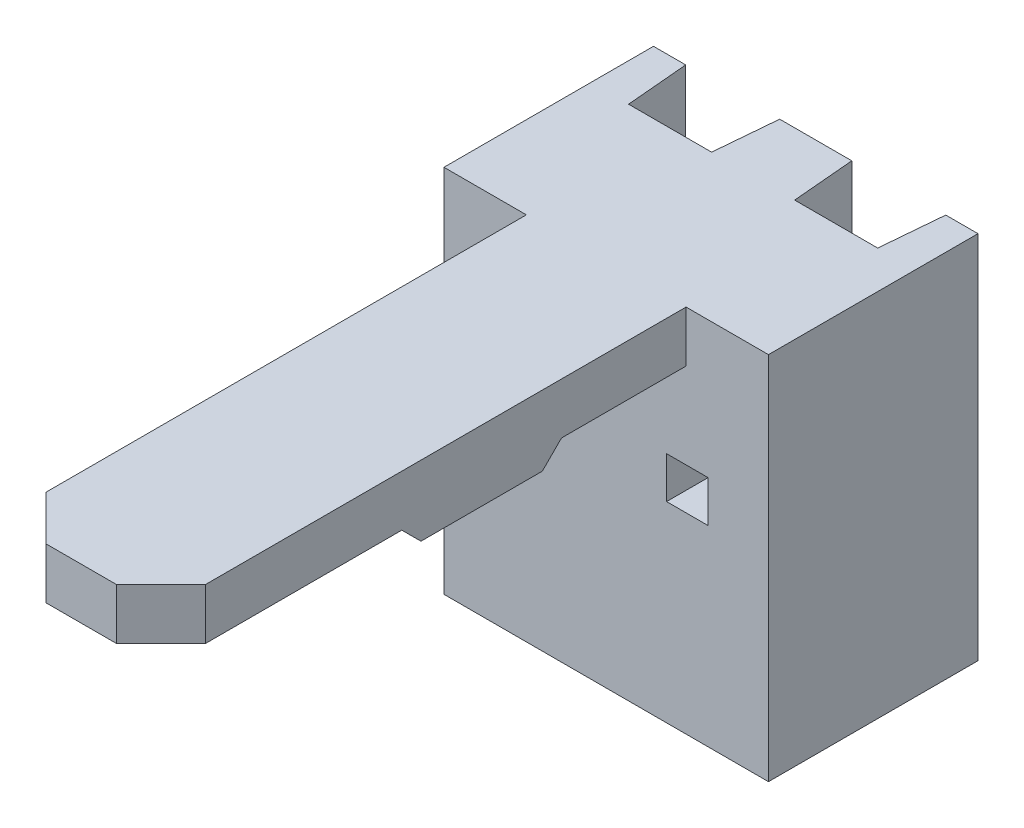
ISO-10303-21;
HEADER;
FILE_DESCRIPTION(('STEP AP214'),'2;1');
FILE_NAME('part.step','',(''),(''),'','','');
FILE_SCHEMA(('AUTOMOTIVE_DESIGN { 1 0 10303 214 1 1 1 1 }'));
ENDSEC;
DATA;
#1=APPLICATION_CONTEXT('core data for automotive mechanical design processes');
#2=APPLICATION_PROTOCOL_DEFINITION('international standard','automotive_design',2000,#1);
#3=PRODUCT_CONTEXT('',#1,'mechanical');
#4=PRODUCT('Part','Part','',(#3));
#5=PRODUCT_RELATED_PRODUCT_CATEGORY('part','',(#4));
#6=PRODUCT_DEFINITION_FORMATION('','',#4);
#7=PRODUCT_DEFINITION_CONTEXT('part definition',#1,'design');
#8=PRODUCT_DEFINITION('design','',#6,#7);
#9=PRODUCT_DEFINITION_SHAPE('','',#8);
#10=(LENGTH_UNIT() NAMED_UNIT(*) SI_UNIT(.MILLI.,.METRE.));
#11=(NAMED_UNIT(*) PLANE_ANGLE_UNIT() SI_UNIT($,.RADIAN.));
#12=(NAMED_UNIT(*) SI_UNIT($,.STERADIAN.) SOLID_ANGLE_UNIT());
#13=UNCERTAINTY_MEASURE_WITH_UNIT(LENGTH_MEASURE(1.E-05),#10,'distance_accuracy_value','');
#14=(GEOMETRIC_REPRESENTATION_CONTEXT(3) GLOBAL_UNCERTAINTY_ASSIGNED_CONTEXT((#13)) GLOBAL_UNIT_ASSIGNED_CONTEXT((#10,
#11,#12)) REPRESENTATION_CONTEXT('',''));
#15=CARTESIAN_POINT('',(0.,0.,0.));
#16=DIRECTION('',(0.,0.,1.));
#17=DIRECTION('',(1.,0.,0.));
#18=AXIS2_PLACEMENT_3D('',#15,#16,#17);
#19=CARTESIAN_POINT('',(0.,0.,-3.28));
#20=DIRECTION('',(0.,0.,1.));
#21=DIRECTION('',(1.,0.,0.));
#22=AXIS2_PLACEMENT_3D('',#19,#20,#21);
#23=PLANE('',#22);
#24=DIRECTION('',(1.,0.,0.));
#25=VECTOR('',#24,1.);
#26=CARTESIAN_POINT('',(0.,-2.895,-3.28));
#27=LINE('',#26,#25);
#28=CARTESIAN_POINT('',(-0.564261109744597,-2.895,-3.28));
#29=VERTEX_POINT('',#28);
#30=CARTESIAN_POINT('',(0.564261109744597,-2.895,-3.28));
#31=VERTEX_POINT('',#30);
#32=EDGE_CURVE('E287',#29,#31,#27,.T.);
#33=ORIENTED_EDGE('',*,*,#32,.F.);
#34=DIRECTION('',(0.,1.,0.));
#35=VECTOR('',#34,1.);
#36=CARTESIAN_POINT('',(-0.564261109744589,3.061095129369,-3.28));
#37=LINE('',#36,#35);
#38=CARTESIAN_POINT('',(-0.564261109744597,2.895,-3.28));
#39=VERTEX_POINT('',#38);
#40=EDGE_CURVE('E289',#29,#39,#37,.T.);
#41=ORIENTED_EDGE('',*,*,#40,.T.);
#42=DIRECTION('',(1.,0.,0.));
#43=VECTOR('',#42,1.);
#44=CARTESIAN_POINT('',(0.,2.895,-3.28));
#45=LINE('',#44,#43);
#46=CARTESIAN_POINT('',(0.564261109744597,2.895,-3.28));
#47=VERTEX_POINT('',#46);
#48=EDGE_CURVE('E19',#47,#39,#45,.F.);
#49=ORIENTED_EDGE('',*,*,#48,.F.);
#50=DIRECTION('',(0.,1.,0.));
#51=VECTOR('',#50,1.);
#52=CARTESIAN_POINT('',(0.564261109744589,3.061095129369,-3.28));
#53=LINE('',#52,#51);
#54=EDGE_CURVE('E320',#47,#31,#53,.F.);
#55=ORIENTED_EDGE('',*,*,#54,.T.);
#56=EDGE_LOOP('',(#33,#41,#49,#55));
#57=FACE_BOUND('',#56,.T.);
#58=ADVANCED_FACE('F16',(#57),#23,.F.);
#59=CARTESIAN_POINT('',(-0.65,3.061095129369,-2.3));
#60=DIRECTION('',(0.996194698091745,0.,0.087155742747664));
#61=DIRECTION('',(0.087155742747664,0.,-0.996194698091745));
#62=AXIS2_PLACEMENT_3D('',#59,#60,#61);
#63=PLANE('',#62);
#64=DIRECTION('',(0.087155742747664,0.,-0.996194698091745));
#65=VECTOR('',#64,1.);
#66=CARTESIAN_POINT('',(-0.65,-2.895,-2.3));
#67=LINE('',#66,#65);
#68=CARTESIAN_POINT('',(-0.65,-2.895,-2.3));
#69=VERTEX_POINT('',#68);
#70=EDGE_CURVE('E270',#69,#29,#67,.T.);
#71=ORIENTED_EDGE('',*,*,#70,.F.);
#72=DIRECTION('',(0.,1.,0.));
#73=VECTOR('',#72,1.);
#74=CARTESIAN_POINT('',(-0.65,-2.895,-2.3));
#75=LINE('',#74,#73);
#76=CARTESIAN_POINT('',(-0.65,2.895,-2.3));
#77=VERTEX_POINT('',#76);
#78=EDGE_CURVE('E296',#69,#77,#75,.T.);
#79=ORIENTED_EDGE('',*,*,#78,.T.);
#80=DIRECTION('',(0.087155742747664,0.,-0.996194698091745));
#81=VECTOR('',#80,1.);
#82=CARTESIAN_POINT('',(-0.65,2.895,-2.3));
#83=LINE('',#82,#81);
#84=EDGE_CURVE('E279',#39,#77,#83,.F.);
#85=ORIENTED_EDGE('',*,*,#84,.F.);
#86=ORIENTED_EDGE('',*,*,#40,.F.);
#87=EDGE_LOOP('',(#71,#79,#85,#86));
#88=FACE_BOUND('',#87,.T.);
#89=ADVANCED_FACE('F294',(#88),#63,.F.);
#90=CARTESIAN_POINT('',(-1.595,0.755,0.));
#91=DIRECTION('',(-1.,0.,0.));
#92=DIRECTION('',(0.,0.,1.));
#93=AXIS2_PLACEMENT_3D('',#90,#91,#92);
#94=PLANE('',#93);
#95=DIRECTION('',(0.,0.,-1.));
#96=VECTOR('',#95,1.);
#97=CARTESIAN_POINT('',(-1.595,0.105,0.));
#98=LINE('',#97,#96);
#99=CARTESIAN_POINT('',(-1.595,0.105,0.));
#100=VERTEX_POINT('',#99);
#101=CARTESIAN_POINT('',(-1.595,0.105,-2.3));
#102=VERTEX_POINT('',#101);
#103=EDGE_CURVE('E323',#100,#102,#98,.T.);
#104=ORIENTED_EDGE('',*,*,#103,.T.);
#105=DIRECTION('',(0.,1.,0.));
#106=VECTOR('',#105,1.);
#107=CARTESIAN_POINT('',(-1.595,-2.895,-2.3));
#108=LINE('',#107,#106);
#109=CARTESIAN_POINT('',(-1.595,0.755,-2.3));
#110=VERTEX_POINT('',#109);
#111=EDGE_CURVE('E337',#102,#110,#108,.T.);
#112=ORIENTED_EDGE('',*,*,#111,.T.);
#113=DIRECTION('',(0.,0.,1.));
#114=VECTOR('',#113,1.);
#115=CARTESIAN_POINT('',(-1.595,0.755,0.));
#116=LINE('',#115,#114);
#117=CARTESIAN_POINT('',(-1.595,0.755,0.));
#118=VERTEX_POINT('',#117);
#119=EDGE_CURVE('E348',#110,#118,#116,.T.);
#120=ORIENTED_EDGE('',*,*,#119,.T.);
#121=DIRECTION('',(0.,1.,0.));
#122=VECTOR('',#121,1.);
#123=CARTESIAN_POINT('',(-1.595,0.755,0.));
#124=LINE('',#123,#122);
#125=EDGE_CURVE('E292',#100,#118,#124,.T.);
#126=ORIENTED_EDGE('',*,*,#125,.F.);
#127=EDGE_LOOP('',(#104,#112,#120,#126));
#128=FACE_BOUND('',#127,.T.);
#129=ADVANCED_FACE('F641',(#128),#94,.F.);
#130=CARTESIAN_POINT('',(0.945,0.755,0.));
#131=DIRECTION('',(-1.,0.,0.));
#132=DIRECTION('',(0.,0.,1.));
#133=AXIS2_PLACEMENT_3D('',#130,#131,#132);
#134=PLANE('',#133);
#135=DIRECTION('',(0.,0.,-1.));
#136=VECTOR('',#135,1.);
#137=CARTESIAN_POINT('',(0.945,0.105,0.));
#138=LINE('',#137,#136);
#139=CARTESIAN_POINT('',(0.945,0.105,0.));
#140=VERTEX_POINT('',#139);
#141=CARTESIAN_POINT('',(0.945,0.105,-2.3));
#142=VERTEX_POINT('',#141);
#143=EDGE_CURVE('E355',#140,#142,#138,.T.);
#144=ORIENTED_EDGE('',*,*,#143,.T.);
#145=DIRECTION('',(0.,1.,0.));
#146=VECTOR('',#145,1.);
#147=CARTESIAN_POINT('',(0.945,0.755,-2.3));
#148=LINE('',#147,#146);
#149=CARTESIAN_POINT('',(0.945,0.755,-2.3));
#150=VERTEX_POINT('',#149);
#151=EDGE_CURVE('E309',#150,#142,#148,.F.);
#152=ORIENTED_EDGE('',*,*,#151,.F.);
#153=DIRECTION('',(0.,0.,1.));
#154=VECTOR('',#153,1.);
#155=CARTESIAN_POINT('',(0.945,0.755,0.));
#156=LINE('',#155,#154);
#157=CARTESIAN_POINT('',(0.945,0.755,0.));
#158=VERTEX_POINT('',#157);
#159=EDGE_CURVE('E363',#150,#158,#156,.T.);
#160=ORIENTED_EDGE('',*,*,#159,.T.);
#161=DIRECTION('',(0.,1.,0.));
#162=VECTOR('',#161,1.);
#163=CARTESIAN_POINT('',(0.945,0.755,0.));
#164=LINE('',#163,#162);
#165=EDGE_CURVE('E312',#140,#158,#164,.T.);
#166=ORIENTED_EDGE('',*,*,#165,.F.);
#167=EDGE_LOOP('',(#144,#152,#160,#166));
#168=FACE_BOUND('',#167,.T.);
#169=ADVANCED_FACE('F631',(#168),#134,.F.);
#170=CARTESIAN_POINT('',(0.65,3.061095129369,-2.3));
#171=DIRECTION('',(-0.996194698091745,0.,0.087155742747664));
#172=DIRECTION('',(0.087155742747664,0.,0.996194698091745));
#173=AXIS2_PLACEMENT_3D('',#170,#171,#172);
#174=PLANE('',#173);
#175=DIRECTION('',(0.087155742747664,0.,0.996194698091745));
#176=VECTOR('',#175,1.);
#177=CARTESIAN_POINT('',(0.65,2.895,-2.3));
#178=LINE('',#177,#176);
#179=CARTESIAN_POINT('',(0.65,2.895,-2.3));
#180=VERTEX_POINT('',#179);
#181=EDGE_CURVE('E282',#180,#47,#178,.F.);
#182=ORIENTED_EDGE('',*,*,#181,.F.);
#183=DIRECTION('',(0.,1.,0.));
#184=VECTOR('',#183,1.);
#185=CARTESIAN_POINT('',(0.65,-2.895,-2.3));
#186=LINE('',#185,#184);
#187=CARTESIAN_POINT('',(0.65,-2.895,-2.3));
#188=VERTEX_POINT('',#187);
#189=EDGE_CURVE('E372',#180,#188,#186,.F.);
#190=ORIENTED_EDGE('',*,*,#189,.T.);
#191=DIRECTION('',(0.087155742747664,0.,0.996194698091745));
#192=VECTOR('',#191,1.);
#193=CARTESIAN_POINT('',(0.65,-2.895,-2.3));
#194=LINE('',#193,#192);
#195=EDGE_CURVE('E315',#31,#188,#194,.T.);
#196=ORIENTED_EDGE('',*,*,#195,.F.);
#197=ORIENTED_EDGE('',*,*,#54,.F.);
#198=EDGE_LOOP('',(#182,#190,#196,#197));
#199=FACE_BOUND('',#198,.T.);
#200=ADVANCED_FACE('F628',(#199),#174,.F.);
#201=CARTESIAN_POINT('',(-1.595,0.105,0.));
#202=DIRECTION('',(0.,-1.,0.));
#203=DIRECTION('',(0.,0.,-1.));
#204=AXIS2_PLACEMENT_3D('',#201,#202,#203);
#205=PLANE('',#204);
#206=DIRECTION('',(0.,0.,-1.));
#207=VECTOR('',#206,1.);
#208=CARTESIAN_POINT('',(-0.945,0.105,0.));
#209=LINE('',#208,#207);
#210=CARTESIAN_POINT('',(-0.945,0.105,0.));
#211=VERTEX_POINT('',#210);
#212=CARTESIAN_POINT('',(-0.945,0.105,-2.3));
#213=VERTEX_POINT('',#212);
#214=EDGE_CURVE('E408',#211,#213,#209,.T.);
#215=ORIENTED_EDGE('',*,*,#214,.T.);
#216=DIRECTION('',(1.,0.,0.));
#217=VECTOR('',#216,1.);
#218=CARTESIAN_POINT('',(-0.65,0.105,-2.3));
#219=LINE('',#218,#217);
#220=EDGE_CURVE('E340',#213,#102,#219,.F.);
#221=ORIENTED_EDGE('',*,*,#220,.T.);
#222=ORIENTED_EDGE('',*,*,#103,.F.);
#223=DIRECTION('',(1.,0.,0.));
#224=VECTOR('',#223,1.);
#225=CARTESIAN_POINT('',(-1.595,0.105,0.));
#226=LINE('',#225,#224);
#227=EDGE_CURVE('E326',#211,#100,#226,.F.);
#228=ORIENTED_EDGE('',*,*,#227,.F.);
#229=EDGE_LOOP('',(#215,#221,#222,#228));
#230=FACE_BOUND('',#229,.T.);
#231=ADVANCED_FACE('F630',(#230),#205,.F.);
#232=CARTESIAN_POINT('',(-0.65,-2.895,-2.3));
#233=DIRECTION('',(0.,0.,1.));
#234=DIRECTION('',(1.,0.,0.));
#235=AXIS2_PLACEMENT_3D('',#232,#233,#234);
#236=PLANE('',#235);
#237=DIRECTION('',(0.,1.,0.));
#238=VECTOR('',#237,1.);
#239=CARTESIAN_POINT('',(-0.945,0.105,-2.3));
#240=LINE('',#239,#238);
#241=CARTESIAN_POINT('',(-0.945,0.755,-2.3));
#242=VERTEX_POINT('',#241);
#243=EDGE_CURVE('E411',#213,#242,#240,.T.);
#244=ORIENTED_EDGE('',*,*,#243,.T.);
#245=DIRECTION('',(1.,0.,0.));
#246=VECTOR('',#245,1.);
#247=CARTESIAN_POINT('',(-0.945,0.755,-2.3));
#248=LINE('',#247,#246);
#249=EDGE_CURVE('E344',#242,#110,#248,.F.);
#250=ORIENTED_EDGE('',*,*,#249,.T.);
#251=ORIENTED_EDGE('',*,*,#111,.F.);
#252=ORIENTED_EDGE('',*,*,#220,.F.);
#253=EDGE_LOOP('',(#244,#250,#251,#252));
#254=FACE_BOUND('',#253,.T.);
#255=DIRECTION('',(0.,1.,0.));
#256=VECTOR('',#255,1.);
#257=CARTESIAN_POINT('',(-1.95,3.061095129369,-2.3));
#258=LINE('',#257,#256);
#259=CARTESIAN_POINT('',(-1.95,-2.895,-2.3));
#260=VERTEX_POINT('',#259);
#261=CARTESIAN_POINT('',(-1.95,2.895,-2.3));
#262=VERTEX_POINT('',#261);
#263=EDGE_CURVE('E389',#260,#262,#258,.T.);
#264=ORIENTED_EDGE('',*,*,#263,.T.);
#265=DIRECTION('',(1.,0.,0.));
#266=VECTOR('',#265,1.);
#267=CARTESIAN_POINT('',(-0.65,2.895,-2.3));
#268=LINE('',#267,#266);
#269=EDGE_CURVE('E332',#77,#262,#268,.F.);
#270=ORIENTED_EDGE('',*,*,#269,.F.);
#271=ORIENTED_EDGE('',*,*,#78,.F.);
#272=DIRECTION('',(1.,0.,0.));
#273=VECTOR('',#272,1.);
#274=CARTESIAN_POINT('',(-0.65,-2.895,-2.3));
#275=LINE('',#274,#273);
#276=EDGE_CURVE('E334',#260,#69,#275,.T.);
#277=ORIENTED_EDGE('',*,*,#276,.F.);
#278=EDGE_LOOP('',(#264,#270,#271,#277));
#279=FACE_BOUND('',#278,.T.);
#280=ADVANCED_FACE('F638',(#254,#279),#236,.F.);
#281=CARTESIAN_POINT('',(-0.945,0.755,0.));
#282=DIRECTION('',(0.,1.,0.));
#283=DIRECTION('',(0.,0.,1.));
#284=AXIS2_PLACEMENT_3D('',#281,#282,#283);
#285=PLANE('',#284);
#286=ORIENTED_EDGE('',*,*,#119,.F.);
#287=ORIENTED_EDGE('',*,*,#249,.F.);
#288=DIRECTION('',(0.,0.,-1.));
#289=VECTOR('',#288,1.);
#290=CARTESIAN_POINT('',(-0.945,0.755,0.));
#291=LINE('',#290,#289);
#292=CARTESIAN_POINT('',(-0.945,0.755,0.));
#293=VERTEX_POINT('',#292);
#294=EDGE_CURVE('E414',#242,#293,#291,.F.);
#295=ORIENTED_EDGE('',*,*,#294,.T.);
#296=DIRECTION('',(1.,0.,0.));
#297=VECTOR('',#296,1.);
#298=CARTESIAN_POINT('',(-0.945,0.755,0.));
#299=LINE('',#298,#297);
#300=EDGE_CURVE('E352',#118,#293,#299,.T.);
#301=ORIENTED_EDGE('',*,*,#300,.F.);
#302=EDGE_LOOP('',(#286,#287,#295,#301));
#303=FACE_BOUND('',#302,.T.);
#304=ADVANCED_FACE('F728',(#303),#285,.F.);
#305=CARTESIAN_POINT('',(0.945,0.105,0.));
#306=DIRECTION('',(0.,-1.,0.));
#307=DIRECTION('',(0.,0.,-1.));
#308=AXIS2_PLACEMENT_3D('',#305,#306,#307);
#309=PLANE('',#308);
#310=DIRECTION('',(0.,0.,-1.));
#311=VECTOR('',#310,1.);
#312=CARTESIAN_POINT('',(1.595,0.105,0.));
#313=LINE('',#312,#311);
#314=CARTESIAN_POINT('',(1.595,0.105,0.));
#315=VERTEX_POINT('',#314);
#316=CARTESIAN_POINT('',(1.595,0.105,-2.3));
#317=VERTEX_POINT('',#316);
#318=EDGE_CURVE('E418',#315,#317,#313,.T.);
#319=ORIENTED_EDGE('',*,*,#318,.T.);
#320=DIRECTION('',(1.,0.,0.));
#321=VECTOR('',#320,1.);
#322=CARTESIAN_POINT('',(1.95,0.105,-2.3));
#323=LINE('',#322,#321);
#324=EDGE_CURVE('E382',#317,#142,#323,.F.);
#325=ORIENTED_EDGE('',*,*,#324,.T.);
#326=ORIENTED_EDGE('',*,*,#143,.F.);
#327=DIRECTION('',(1.,0.,0.));
#328=VECTOR('',#327,1.);
#329=CARTESIAN_POINT('',(0.945,0.105,0.));
#330=LINE('',#329,#328);
#331=EDGE_CURVE('E359',#315,#140,#330,.F.);
#332=ORIENTED_EDGE('',*,*,#331,.F.);
#333=EDGE_LOOP('',(#319,#325,#326,#332));
#334=FACE_BOUND('',#333,.T.);
#335=ADVANCED_FACE('F724',(#334),#309,.F.);
#336=CARTESIAN_POINT('',(1.595,0.755,0.));
#337=DIRECTION('',(0.,1.,0.));
#338=DIRECTION('',(0.,0.,1.));
#339=AXIS2_PLACEMENT_3D('',#336,#337,#338);
#340=PLANE('',#339);
#341=ORIENTED_EDGE('',*,*,#159,.F.);
#342=DIRECTION('',(1.,0.,0.));
#343=VECTOR('',#342,1.);
#344=CARTESIAN_POINT('',(1.95,0.755,-2.3));
#345=LINE('',#344,#343);
#346=CARTESIAN_POINT('',(1.595,0.755,-2.3));
#347=VERTEX_POINT('',#346);
#348=EDGE_CURVE('E379',#150,#347,#345,.T.);
#349=ORIENTED_EDGE('',*,*,#348,.T.);
#350=DIRECTION('',(0.,0.,-1.));
#351=VECTOR('',#350,1.);
#352=CARTESIAN_POINT('',(1.595,0.755,0.));
#353=LINE('',#352,#351);
#354=CARTESIAN_POINT('',(1.595,0.755,0.));
#355=VERTEX_POINT('',#354);
#356=EDGE_CURVE('E425',#347,#355,#353,.F.);
#357=ORIENTED_EDGE('',*,*,#356,.T.);
#358=DIRECTION('',(1.,0.,0.));
#359=VECTOR('',#358,1.);
#360=CARTESIAN_POINT('',(1.595,0.755,0.));
#361=LINE('',#360,#359);
#362=EDGE_CURVE('E367',#158,#355,#361,.T.);
#363=ORIENTED_EDGE('',*,*,#362,.F.);
#364=EDGE_LOOP('',(#341,#349,#357,#363));
#365=FACE_BOUND('',#364,.T.);
#366=ADVANCED_FACE('F720',(#365),#340,.F.);
#367=CARTESIAN_POINT('',(1.95,-2.895,-2.3));
#368=DIRECTION('',(0.,0.,1.));
#369=DIRECTION('',(1.,0.,0.));
#370=AXIS2_PLACEMENT_3D('',#367,#368,#369);
#371=PLANE('',#370);
#372=DIRECTION('',(0.,1.,0.));
#373=VECTOR('',#372,1.);
#374=CARTESIAN_POINT('',(1.595,0.105,-2.3));
#375=LINE('',#374,#373);
#376=EDGE_CURVE('E421',#317,#347,#375,.T.);
#377=ORIENTED_EDGE('',*,*,#376,.T.);
#378=ORIENTED_EDGE('',*,*,#348,.F.);
#379=ORIENTED_EDGE('',*,*,#151,.T.);
#380=ORIENTED_EDGE('',*,*,#324,.F.);
#381=EDGE_LOOP('',(#377,#378,#379,#380));
#382=FACE_BOUND('',#381,.T.);
#383=ORIENTED_EDGE('',*,*,#189,.F.);
#384=DIRECTION('',(1.,0.,0.));
#385=VECTOR('',#384,1.);
#386=CARTESIAN_POINT('',(1.95,2.895,-2.3));
#387=LINE('',#386,#385);
#388=CARTESIAN_POINT('',(1.95,2.895,-2.3));
#389=VERTEX_POINT('',#388);
#390=EDGE_CURVE('E370',#389,#180,#387,.F.);
#391=ORIENTED_EDGE('',*,*,#390,.F.);
#392=DIRECTION('',(0.,1.,0.));
#393=VECTOR('',#392,1.);
#394=CARTESIAN_POINT('',(1.95,3.061095129369,-2.3));
#395=LINE('',#394,#393);
#396=CARTESIAN_POINT('',(1.95,-2.895,-2.3));
#397=VERTEX_POINT('',#396);
#398=EDGE_CURVE('E432',#389,#397,#395,.F.);
#399=ORIENTED_EDGE('',*,*,#398,.T.);
#400=DIRECTION('',(1.,0.,0.));
#401=VECTOR('',#400,1.);
#402=CARTESIAN_POINT('',(1.95,-2.895,-2.3));
#403=LINE('',#402,#401);
#404=EDGE_CURVE('E376',#188,#397,#403,.T.);
#405=ORIENTED_EDGE('',*,*,#404,.F.);
#406=EDGE_LOOP('',(#383,#391,#399,#405));
#407=FACE_BOUND('',#406,.T.);
#408=ADVANCED_FACE('F626',(#382,#407),#371,.F.);
#409=CARTESIAN_POINT('',(-1.95,3.061095129369,-2.3));
#410=DIRECTION('',(-0.996194698091745,0.,0.087155742747664));
#411=DIRECTION('',(0.087155742747664,0.,0.996194698091745));
#412=AXIS2_PLACEMENT_3D('',#409,#410,#411);
#413=PLANE('',#412);
#414=DIRECTION('',(0.087155742747664,0.,0.996194698091745));
#415=VECTOR('',#414,1.);
#416=CARTESIAN_POINT('',(-1.95,2.895,-2.3));
#417=LINE('',#416,#415);
#418=CARTESIAN_POINT('',(-2.0357388902551,2.895,-3.27999999999999));
#419=VERTEX_POINT('',#418);
#420=EDGE_CURVE('E393',#262,#419,#417,.F.);
#421=ORIENTED_EDGE('',*,*,#420,.F.);
#422=ORIENTED_EDGE('',*,*,#263,.F.);
#423=DIRECTION('',(0.087155742747664,0.,0.996194698091745));
#424=VECTOR('',#423,1.);
#425=CARTESIAN_POINT('',(-1.95,-2.895,-2.3));
#426=LINE('',#425,#424);
#427=CARTESIAN_POINT('',(-2.0357388902552,-2.895,-3.27999999999998));
#428=VERTEX_POINT('',#427);
#429=EDGE_CURVE('E386',#428,#260,#426,.T.);
#430=ORIENTED_EDGE('',*,*,#429,.F.);
#431=DIRECTION('',(0.,1.,0.));
#432=VECTOR('',#431,1.);
#433=CARTESIAN_POINT('',(-2.035738890255,0.,-3.28));
#434=LINE('',#433,#432);
#435=EDGE_CURVE('E439',#428,#419,#434,.T.);
#436=ORIENTED_EDGE('',*,*,#435,.T.);
#437=EDGE_LOOP('',(#421,#422,#430,#436));
#438=FACE_BOUND('',#437,.T.);
#439=ADVANCED_FACE('F713',(#438),#413,.F.);
#440=CARTESIAN_POINT('',(0.,1.945,2.1));
#441=DIRECTION('',(0.,-0.707106781186548,-0.707106781186548));
#442=DIRECTION('',(0.,0.707106781186548,-0.707106781186548));
#443=AXIS2_PLACEMENT_3D('',#440,#441,#442);
#444=PLANE('',#443);
#445=DIRECTION('',(0.,0.707106781186548,-0.707106781186548));
#446=VECTOR('',#445,1.);
#447=CARTESIAN_POINT('',(-1.25,1.945,2.1));
#448=LINE('',#447,#446);
#449=CARTESIAN_POINT('',(-1.25,1.795,2.25));
#450=VERTEX_POINT('',#449);
#451=CARTESIAN_POINT('',(-1.25,2.095,1.95));
#452=VERTEX_POINT('',#451);
#453=EDGE_CURVE('E399',#450,#452,#448,.T.);
#454=ORIENTED_EDGE('',*,*,#453,.T.);
#455=DIRECTION('',(1.,0.,0.));
#456=VECTOR('',#455,1.);
#457=CARTESIAN_POINT('',(-1.25,2.095,1.95));
#458=LINE('',#457,#456);
#459=CARTESIAN_POINT('',(1.25,2.095,1.95));
#460=VERTEX_POINT('',#459);
#461=EDGE_CURVE('E451',#460,#452,#458,.F.);
#462=ORIENTED_EDGE('',*,*,#461,.F.);
#463=DIRECTION('',(0.,0.707106781186548,-0.707106781186548));
#464=VECTOR('',#463,1.);
#465=CARTESIAN_POINT('',(1.25,1.945,2.1));
#466=LINE('',#465,#464);
#467=CARTESIAN_POINT('',(1.25,1.795,2.25));
#468=VERTEX_POINT('',#467);
#469=EDGE_CURVE('E396',#460,#468,#466,.F.);
#470=ORIENTED_EDGE('',*,*,#469,.T.);
#471=DIRECTION('',(1.,0.,0.));
#472=VECTOR('',#471,1.);
#473=CARTESIAN_POINT('',(0.,1.795,2.25));
#474=LINE('',#473,#472);
#475=EDGE_CURVE('E447',#450,#468,#474,.T.);
#476=ORIENTED_EDGE('',*,*,#475,.F.);
#477=EDGE_LOOP('',(#454,#462,#470,#476));
#478=FACE_BOUND('',#477,.T.);
#479=ADVANCED_FACE('F709',(#478),#444,.T.);
#480=CARTESIAN_POINT('',(0.,1.945,4.3));
#481=DIRECTION('',(0.,-0.707106781186548,0.707106781186548));
#482=DIRECTION('',(0.,-0.707106781186548,-0.707106781186548));
#483=AXIS2_PLACEMENT_3D('',#480,#481,#482);
#484=PLANE('',#483);
#485=DIRECTION('',(0.,-0.707106781186548,-0.707106781186548));
#486=VECTOR('',#485,1.);
#487=CARTESIAN_POINT('',(1.25,1.945,4.3));
#488=LINE('',#487,#486);
#489=CARTESIAN_POINT('',(1.25,1.795,4.15));
#490=VERTEX_POINT('',#489);
#491=CARTESIAN_POINT('',(1.25,2.095,4.45));
#492=VERTEX_POINT('',#491);
#493=EDGE_CURVE('E405',#490,#492,#488,.F.);
#494=ORIENTED_EDGE('',*,*,#493,.T.);
#495=DIRECTION('',(1.,0.,0.));
#496=VECTOR('',#495,1.);
#497=CARTESIAN_POINT('',(-1.25,2.095,4.45));
#498=LINE('',#497,#496);
#499=CARTESIAN_POINT('',(-1.25,2.095,4.45));
#500=VERTEX_POINT('',#499);
#501=EDGE_CURVE('E455',#500,#492,#498,.T.);
#502=ORIENTED_EDGE('',*,*,#501,.F.);
#503=DIRECTION('',(0.,-0.707106781186548,-0.707106781186548));
#504=VECTOR('',#503,1.);
#505=CARTESIAN_POINT('',(-1.25,1.945,4.3));
#506=LINE('',#505,#504);
#507=CARTESIAN_POINT('',(-1.25,1.795,4.15));
#508=VERTEX_POINT('',#507);
#509=EDGE_CURVE('E402',#500,#508,#506,.T.);
#510=ORIENTED_EDGE('',*,*,#509,.T.);
#511=DIRECTION('',(1.,0.,0.));
#512=VECTOR('',#511,1.);
#513=CARTESIAN_POINT('',(0.,1.795,4.15));
#514=LINE('',#513,#512);
#515=EDGE_CURVE('E443',#490,#508,#514,.F.);
#516=ORIENTED_EDGE('',*,*,#515,.F.);
#517=EDGE_LOOP('',(#494,#502,#510,#516));
#518=FACE_BOUND('',#517,.T.);
#519=ADVANCED_FACE('F705',(#518),#484,.T.);
#520=CARTESIAN_POINT('',(-0.945,0.105,0.));
#521=DIRECTION('',(1.,0.,0.));
#522=DIRECTION('',(0.,0.,-1.));
#523=AXIS2_PLACEMENT_3D('',#520,#521,#522);
#524=PLANE('',#523);
#525=ORIENTED_EDGE('',*,*,#294,.F.);
#526=ORIENTED_EDGE('',*,*,#243,.F.);
#527=ORIENTED_EDGE('',*,*,#214,.F.);
#528=DIRECTION('',(0.,1.,0.));
#529=VECTOR('',#528,1.);
#530=CARTESIAN_POINT('',(-0.945,0.,0.));
#531=LINE('',#530,#529);
#532=EDGE_CURVE('E468',#293,#211,#531,.F.);
#533=ORIENTED_EDGE('',*,*,#532,.F.);
#534=EDGE_LOOP('',(#525,#526,#527,#533));
#535=FACE_BOUND('',#534,.T.);
#536=ADVANCED_FACE('F701',(#535),#524,.F.);
#537=CARTESIAN_POINT('',(1.595,0.105,0.));
#538=DIRECTION('',(1.,0.,0.));
#539=DIRECTION('',(0.,0.,-1.));
#540=AXIS2_PLACEMENT_3D('',#537,#538,#539);
#541=PLANE('',#540);
#542=ORIENTED_EDGE('',*,*,#356,.F.);
#543=ORIENTED_EDGE('',*,*,#376,.F.);
#544=ORIENTED_EDGE('',*,*,#318,.F.);
#545=DIRECTION('',(0.,1.,0.));
#546=VECTOR('',#545,1.);
#547=CARTESIAN_POINT('',(1.595,0.,0.));
#548=LINE('',#547,#546);
#549=EDGE_CURVE('E472',#355,#315,#548,.F.);
#550=ORIENTED_EDGE('',*,*,#549,.F.);
#551=EDGE_LOOP('',(#542,#543,#544,#550));
#552=FACE_BOUND('',#551,.T.);
#553=ADVANCED_FACE('F698',(#552),#541,.F.);
#554=CARTESIAN_POINT('',(1.95,3.061095129369,-2.3));
#555=DIRECTION('',(0.996194698091745,0.,0.087155742747664));
#556=DIRECTION('',(0.087155742747664,0.,-0.996194698091745));
#557=AXIS2_PLACEMENT_3D('',#554,#555,#556);
#558=PLANE('',#557);
#559=DIRECTION('',(0.0871557427472491,0.,-0.996194698091781));
#560=VECTOR('',#559,1.);
#561=CARTESIAN_POINT('',(1.95,-2.895,-2.3));
#562=LINE('',#561,#560);
#563=CARTESIAN_POINT('',(2.0357388902551,-2.895,-3.27999999999999));
#564=VERTEX_POINT('',#563);
#565=EDGE_CURVE('E476',#397,#564,#562,.T.);
#566=ORIENTED_EDGE('',*,*,#565,.F.);
#567=ORIENTED_EDGE('',*,*,#398,.F.);
#568=DIRECTION('',(0.087155742747664,0.,-0.996194698091745));
#569=VECTOR('',#568,1.);
#570=CARTESIAN_POINT('',(1.95,2.895,-2.3));
#571=LINE('',#570,#569);
#572=CARTESIAN_POINT('',(2.0357388902551,2.895,-3.27999999999999));
#573=VERTEX_POINT('',#572);
#574=EDGE_CURVE('E429',#573,#389,#571,.F.);
#575=ORIENTED_EDGE('',*,*,#574,.F.);
#576=DIRECTION('',(0.,1.,0.));
#577=VECTOR('',#576,1.);
#578=CARTESIAN_POINT('',(2.035738890255,0.,-3.28));
#579=LINE('',#578,#577);
#580=EDGE_CURVE('E492',#573,#564,#579,.F.);
#581=ORIENTED_EDGE('',*,*,#580,.T.);
#582=EDGE_LOOP('',(#566,#567,#575,#581));
#583=FACE_BOUND('',#582,.T.);
#584=ADVANCED_FACE('F618',(#583),#558,.F.);
#585=CARTESIAN_POINT('',(0.,0.,-3.28));
#586=DIRECTION('',(0.,0.,1.));
#587=DIRECTION('',(1.,0.,0.));
#588=AXIS2_PLACEMENT_3D('',#585,#586,#587);
#589=PLANE('',#588);
#590=DIRECTION('',(1.,0.,0.));
#591=VECTOR('',#590,1.);
#592=CARTESIAN_POINT('',(-2.54,-2.895,-3.28));
#593=LINE('',#592,#591);
#594=CARTESIAN_POINT('',(-2.54,-2.895,-3.28));
#595=VERTEX_POINT('',#594);
#596=EDGE_CURVE('E483',#595,#428,#593,.T.);
#597=ORIENTED_EDGE('',*,*,#596,.F.);
#598=DIRECTION('',(0.,1.,0.));
#599=VECTOR('',#598,1.);
#600=CARTESIAN_POINT('',(-2.54,2.895,-3.28));
#601=LINE('',#600,#599);
#602=CARTESIAN_POINT('',(-2.54,2.895,-3.28));
#603=VERTEX_POINT('',#602);
#604=EDGE_CURVE('E500',#603,#595,#601,.F.);
#605=ORIENTED_EDGE('',*,*,#604,.F.);
#606=DIRECTION('',(1.,0.,0.));
#607=VECTOR('',#606,1.);
#608=CARTESIAN_POINT('',(0.,2.895,-3.28));
#609=LINE('',#608,#607);
#610=EDGE_CURVE('E436',#419,#603,#609,.F.);
#611=ORIENTED_EDGE('',*,*,#610,.F.);
#612=ORIENTED_EDGE('',*,*,#435,.F.);
#613=EDGE_LOOP('',(#597,#605,#611,#612));
#614=FACE_BOUND('',#613,.T.);
#615=ADVANCED_FACE('F691',(#614),#589,.F.);
#616=CARTESIAN_POINT('',(0.,1.795,8.22));
#617=DIRECTION('',(0.,-1.,0.));
#618=DIRECTION('',(0.,0.,-1.));
#619=AXIS2_PLACEMENT_3D('',#616,#617,#618);
#620=PLANE('',#619);
#621=ORIENTED_EDGE('',*,*,#475,.T.);
#622=DIRECTION('',(0.,0.,-1.));
#623=VECTOR('',#622,1.);
#624=CARTESIAN_POINT('',(1.25,1.795,0.));
#625=LINE('',#624,#623);
#626=EDGE_CURVE('E545',#490,#468,#625,.T.);
#627=ORIENTED_EDGE('',*,*,#626,.F.);
#628=ORIENTED_EDGE('',*,*,#515,.T.);
#629=DIRECTION('',(0.,0.,1.));
#630=VECTOR('',#629,1.);
#631=CARTESIAN_POINT('',(-1.25,1.795,0.));
#632=LINE('',#631,#630);
#633=EDGE_CURVE('E520',#450,#508,#632,.T.);
#634=ORIENTED_EDGE('',*,*,#633,.F.);
#635=EDGE_LOOP('',(#621,#627,#628,#634));
#636=FACE_BOUND('',#635,.T.);
#637=ADVANCED_FACE('F687',(#636),#620,.T.);
#638=CARTESIAN_POINT('',(-1.25,2.095,0.));
#639=DIRECTION('',(0.,-1.,0.));
#640=DIRECTION('',(0.,0.,-1.));
#641=AXIS2_PLACEMENT_3D('',#638,#639,#640);
#642=PLANE('',#641);
#643=DIRECTION('',(1.,0.,0.));
#644=VECTOR('',#643,1.);
#645=CARTESIAN_POINT('',(0.,2.095,0.));
#646=LINE('',#645,#644);
#647=CARTESIAN_POINT('',(1.25,2.095,0.));
#648=VERTEX_POINT('',#647);
#649=CARTESIAN_POINT('',(-1.25,2.095,0.));
#650=VERTEX_POINT('',#649);
#651=EDGE_CURVE('E465',#648,#650,#646,.F.);
#652=ORIENTED_EDGE('',*,*,#651,.F.);
#653=DIRECTION('',(0.,0.,-1.));
#654=VECTOR('',#653,1.);
#655=CARTESIAN_POINT('',(1.25,2.095,0.));
#656=LINE('',#655,#654);
#657=EDGE_CURVE('E549',#460,#648,#656,.T.);
#658=ORIENTED_EDGE('',*,*,#657,.F.);
#659=ORIENTED_EDGE('',*,*,#461,.T.);
#660=DIRECTION('',(0.,0.,1.));
#661=VECTOR('',#660,1.);
#662=CARTESIAN_POINT('',(-1.25,2.095,0.));
#663=LINE('',#662,#661);
#664=EDGE_CURVE('E516',#650,#452,#663,.T.);
#665=ORIENTED_EDGE('',*,*,#664,.F.);
#666=EDGE_LOOP('',(#652,#658,#659,#665));
#667=FACE_BOUND('',#666,.T.);
#668=ADVANCED_FACE('F683',(#667),#642,.T.);
#669=CARTESIAN_POINT('',(-1.25,2.095,0.));
#670=DIRECTION('',(0.,-1.,0.));
#671=DIRECTION('',(0.,0.,-1.));
#672=AXIS2_PLACEMENT_3D('',#669,#670,#671);
#673=PLANE('',#672);
#674=DIRECTION('',(0.707106781186548,0.,0.707106781186548));
#675=VECTOR('',#674,1.);
#676=CARTESIAN_POINT('',(-0.9,2.095,7.87));
#677=LINE('',#676,#675);
#678=CARTESIAN_POINT('',(-1.25,2.095,7.52));
#679=VERTEX_POINT('',#678);
#680=CARTESIAN_POINT('',(-0.55,2.095,8.22));
#681=VERTEX_POINT('',#680);
#682=EDGE_CURVE('E524',#679,#681,#677,.T.);
#683=ORIENTED_EDGE('',*,*,#682,.F.);
#684=DIRECTION('',(0.,0.,1.));
#685=VECTOR('',#684,1.);
#686=CARTESIAN_POINT('',(-1.25,2.095,0.));
#687=LINE('',#686,#685);
#688=EDGE_CURVE('E508',#500,#679,#687,.T.);
#689=ORIENTED_EDGE('',*,*,#688,.F.);
#690=ORIENTED_EDGE('',*,*,#501,.T.);
#691=DIRECTION('',(0.,0.,-1.));
#692=VECTOR('',#691,1.);
#693=CARTESIAN_POINT('',(1.25,2.095,0.));
#694=LINE('',#693,#692);
#695=CARTESIAN_POINT('',(1.25,2.095,7.52));
#696=VERTEX_POINT('',#695);
#697=EDGE_CURVE('E561',#696,#492,#694,.T.);
#698=ORIENTED_EDGE('',*,*,#697,.F.);
#699=DIRECTION('',(0.707106781186548,0.,-0.707106781186548));
#700=VECTOR('',#699,1.);
#701=CARTESIAN_POINT('',(0.9,2.095,7.87));
#702=LINE('',#701,#700);
#703=CARTESIAN_POINT('',(0.55,2.095,8.22));
#704=VERTEX_POINT('',#703);
#705=EDGE_CURVE('E542',#704,#696,#702,.T.);
#706=ORIENTED_EDGE('',*,*,#705,.F.);
#707=DIRECTION('',(1.,0.,0.));
#708=VECTOR('',#707,1.);
#709=CARTESIAN_POINT('',(0.,2.095,8.22));
#710=LINE('',#709,#708);
#711=EDGE_CURVE('E535',#681,#704,#710,.T.);
#712=ORIENTED_EDGE('',*,*,#711,.F.);
#713=EDGE_LOOP('',(#683,#689,#690,#698,#706,#712));
#714=FACE_BOUND('',#713,.T.);
#715=ADVANCED_FACE('F679',(#714),#673,.T.);
#716=CARTESIAN_POINT('',(0.,0.,0.));
#717=DIRECTION('',(0.,0.,1.));
#718=DIRECTION('',(1.,0.,0.));
#719=AXIS2_PLACEMENT_3D('',#716,#717,#718);
#720=PLANE('',#719);
#721=ORIENTED_EDGE('',*,*,#362,.T.);
#722=ORIENTED_EDGE('',*,*,#549,.T.);
#723=ORIENTED_EDGE('',*,*,#331,.T.);
#724=ORIENTED_EDGE('',*,*,#165,.T.);
#725=EDGE_LOOP('',(#721,#722,#723,#724));
#726=FACE_BOUND('',#725,.T.);
#727=ORIENTED_EDGE('',*,*,#300,.T.);
#728=ORIENTED_EDGE('',*,*,#532,.T.);
#729=ORIENTED_EDGE('',*,*,#227,.T.);
#730=ORIENTED_EDGE('',*,*,#125,.T.);
#731=EDGE_LOOP('',(#727,#728,#729,#730));
#732=FACE_BOUND('',#731,.T.);
#733=DIRECTION('',(0.,1.,0.));
#734=VECTOR('',#733,1.);
#735=CARTESIAN_POINT('',(1.25,2.095,0.));
#736=LINE('',#735,#734);
#737=CARTESIAN_POINT('',(1.25,2.895,0.));
#738=VERTEX_POINT('',#737);
#739=EDGE_CURVE('E553',#648,#738,#736,.T.);
#740=ORIENTED_EDGE('',*,*,#739,.F.);
#741=ORIENTED_EDGE('',*,*,#651,.T.);
#742=DIRECTION('',(0.,1.,0.));
#743=VECTOR('',#742,1.);
#744=CARTESIAN_POINT('',(-1.25,2.895,0.));
#745=LINE('',#744,#743);
#746=CARTESIAN_POINT('',(-1.25,2.895,0.));
#747=VERTEX_POINT('',#746);
#748=EDGE_CURVE('E512',#747,#650,#745,.F.);
#749=ORIENTED_EDGE('',*,*,#748,.F.);
#750=DIRECTION('',(1.,0.,0.));
#751=VECTOR('',#750,1.);
#752=CARTESIAN_POINT('',(0.,2.895,0.));
#753=LINE('',#752,#751);
#754=CARTESIAN_POINT('',(-2.54,2.895,0.));
#755=VERTEX_POINT('',#754);
#756=EDGE_CURVE('E459',#747,#755,#753,.F.);
#757=ORIENTED_EDGE('',*,*,#756,.T.);
#758=DIRECTION('',(0.,1.,0.));
#759=VECTOR('',#758,1.);
#760=CARTESIAN_POINT('',(-2.54,2.895,0.));
#761=LINE('',#760,#759);
#762=CARTESIAN_POINT('',(-2.54,-2.895,0.));
#763=VERTEX_POINT('',#762);
#764=EDGE_CURVE('E496',#763,#755,#761,.T.);
#765=ORIENTED_EDGE('',*,*,#764,.F.);
#766=DIRECTION('',(1.,0.,0.));
#767=VECTOR('',#766,1.);
#768=CARTESIAN_POINT('',(-2.54,-2.895,0.));
#769=LINE('',#768,#767);
#770=CARTESIAN_POINT('',(2.54,-2.895,0.));
#771=VERTEX_POINT('',#770);
#772=EDGE_CURVE('E479',#771,#763,#769,.F.);
#773=ORIENTED_EDGE('',*,*,#772,.F.);
#774=DIRECTION('',(0.,1.,0.));
#775=VECTOR('',#774,1.);
#776=CARTESIAN_POINT('',(2.54,-2.895,0.));
#777=LINE('',#776,#775);
#778=CARTESIAN_POINT('',(2.54,2.895,0.));
#779=VERTEX_POINT('',#778);
#780=EDGE_CURVE('E565',#779,#771,#777,.F.);
#781=ORIENTED_EDGE('',*,*,#780,.F.);
#782=DIRECTION('',(1.,0.,0.));
#783=VECTOR('',#782,1.);
#784=CARTESIAN_POINT('',(0.,2.895,0.));
#785=LINE('',#784,#783);
#786=EDGE_CURVE('E462',#779,#738,#785,.F.);
#787=ORIENTED_EDGE('',*,*,#786,.T.);
#788=EDGE_LOOP('',(#740,#741,#749,#757,#765,#773,#781,#787));
#789=FACE_BOUND('',#788,.T.);
#790=ADVANCED_FACE('F606',(#726,#732,#789),#720,.T.);
#791=CARTESIAN_POINT('',(-2.54,-2.895,0.));
#792=DIRECTION('',(0.,-1.,0.));
#793=DIRECTION('',(0.,0.,-1.));
#794=AXIS2_PLACEMENT_3D('',#791,#792,#793);
#795=PLANE('',#794);
#796=ORIENTED_EDGE('',*,*,#195,.T.);
#797=ORIENTED_EDGE('',*,*,#404,.T.);
#798=ORIENTED_EDGE('',*,*,#565,.T.);
#799=DIRECTION('',(1.,0.,0.));
#800=VECTOR('',#799,1.);
#801=CARTESIAN_POINT('',(0.,-2.895,-3.28));
#802=LINE('',#801,#800);
#803=CARTESIAN_POINT('',(2.54,-2.895,-3.28));
#804=VERTEX_POINT('',#803);
#805=EDGE_CURVE('E487',#564,#804,#802,.T.);
#806=ORIENTED_EDGE('',*,*,#805,.T.);
#807=DIRECTION('',(0.,0.,-1.));
#808=VECTOR('',#807,1.);
#809=CARTESIAN_POINT('',(2.54,-2.895,0.));
#810=LINE('',#809,#808);
#811=EDGE_CURVE('E569',#771,#804,#810,.T.);
#812=ORIENTED_EDGE('',*,*,#811,.F.);
#813=ORIENTED_EDGE('',*,*,#772,.T.);
#814=DIRECTION('',(0.,0.,1.));
#815=VECTOR('',#814,1.);
#816=CARTESIAN_POINT('',(-2.54,-2.895,0.));
#817=LINE('',#816,#815);
#818=EDGE_CURVE('E504',#595,#763,#817,.T.);
#819=ORIENTED_EDGE('',*,*,#818,.F.);
#820=ORIENTED_EDGE('',*,*,#596,.T.);
#821=ORIENTED_EDGE('',*,*,#429,.T.);
#822=ORIENTED_EDGE('',*,*,#276,.T.);
#823=ORIENTED_EDGE('',*,*,#70,.T.);
#824=ORIENTED_EDGE('',*,*,#32,.T.);
#825=EDGE_LOOP('',(#796,#797,#798,#806,#812,#813,#819,#820,#821,#822,#823,#824));
#826=FACE_BOUND('',#825,.T.);
#827=ADVANCED_FACE('F621',(#826),#795,.T.);
#828=CARTESIAN_POINT('',(0.,0.,-3.28));
#829=DIRECTION('',(0.,0.,1.));
#830=DIRECTION('',(1.,0.,0.));
#831=AXIS2_PLACEMENT_3D('',#828,#829,#830);
#832=PLANE('',#831);
#833=DIRECTION('',(1.,0.,0.));
#834=VECTOR('',#833,1.);
#835=CARTESIAN_POINT('',(0.,2.895,-3.28));
#836=LINE('',#835,#834);
#837=CARTESIAN_POINT('',(2.54,2.895,-3.28));
#838=VERTEX_POINT('',#837);
#839=EDGE_CURVE('E39',#838,#573,#836,.F.);
#840=ORIENTED_EDGE('',*,*,#839,.F.);
#841=DIRECTION('',(0.,1.,0.));
#842=VECTOR('',#841,1.);
#843=CARTESIAN_POINT('',(2.54,-2.895,-3.28));
#844=LINE('',#843,#842);
#845=EDGE_CURVE('E573',#804,#838,#844,.T.);
#846=ORIENTED_EDGE('',*,*,#845,.F.);
#847=ORIENTED_EDGE('',*,*,#805,.F.);
#848=ORIENTED_EDGE('',*,*,#580,.F.);
#849=EDGE_LOOP('',(#840,#846,#847,#848));
#850=FACE_BOUND('',#849,.T.);
#851=ADVANCED_FACE('F620',(#850),#832,.F.);
#852=CARTESIAN_POINT('',(-2.54,2.895,0.));
#853=DIRECTION('',(-1.,0.,0.));
#854=DIRECTION('',(0.,0.,1.));
#855=AXIS2_PLACEMENT_3D('',#852,#853,#854);
#856=PLANE('',#855);
#857=ORIENTED_EDGE('',*,*,#604,.T.);
#858=ORIENTED_EDGE('',*,*,#818,.T.);
#859=ORIENTED_EDGE('',*,*,#764,.T.);
#860=DIRECTION('',(0.,0.,1.));
#861=VECTOR('',#860,1.);
#862=CARTESIAN_POINT('',(-2.54,2.895,0.));
#863=LINE('',#862,#861);
#864=EDGE_CURVE('E576',#603,#755,#863,.T.);
#865=ORIENTED_EDGE('',*,*,#864,.F.);
#866=EDGE_LOOP('',(#857,#858,#859,#865));
#867=FACE_BOUND('',#866,.T.);
#868=ADVANCED_FACE('F668',(#867),#856,.T.);
#869=CARTESIAN_POINT('',(-1.25,2.895,0.));
#870=DIRECTION('',(-1.,0.,0.));
#871=DIRECTION('',(0.,0.,1.));
#872=AXIS2_PLACEMENT_3D('',#869,#870,#871);
#873=PLANE('',#872);
#874=ORIENTED_EDGE('',*,*,#453,.F.);
#875=ORIENTED_EDGE('',*,*,#633,.T.);
#876=ORIENTED_EDGE('',*,*,#509,.F.);
#877=ORIENTED_EDGE('',*,*,#688,.T.);
#878=DIRECTION('',(0.,1.,0.));
#879=VECTOR('',#878,1.);
#880=CARTESIAN_POINT('',(-1.25,2.495,7.52));
#881=LINE('',#880,#879);
#882=CARTESIAN_POINT('',(-1.25,2.895,7.52));
#883=VERTEX_POINT('',#882);
#884=EDGE_CURVE('E527',#883,#679,#881,.F.);
#885=ORIENTED_EDGE('',*,*,#884,.F.);
#886=DIRECTION('',(0.,0.,1.));
#887=VECTOR('',#886,1.);
#888=CARTESIAN_POINT('',(-1.25,2.895,0.));
#889=LINE('',#888,#887);
#890=EDGE_CURVE('E580',#747,#883,#889,.T.);
#891=ORIENTED_EDGE('',*,*,#890,.F.);
#892=ORIENTED_EDGE('',*,*,#748,.T.);
#893=ORIENTED_EDGE('',*,*,#664,.T.);
#894=EDGE_LOOP('',(#874,#875,#876,#877,#885,#891,#892,#893));
#895=FACE_BOUND('',#894,.T.);
#896=ADVANCED_FACE('F664',(#895),#873,.T.);
#897=CARTESIAN_POINT('',(-0.9,2.495,7.87));
#898=DIRECTION('',(-0.707106781186548,0.,0.707106781186548));
#899=DIRECTION('',(0.707106781186548,0.,0.707106781186548));
#900=AXIS2_PLACEMENT_3D('',#897,#898,#899);
#901=PLANE('',#900);
#902=DIRECTION('',(0.707106781186547,0.,0.707106781186548));
#903=VECTOR('',#902,1.);
#904=CARTESIAN_POINT('',(-1.25,2.895,7.52));
#905=LINE('',#904,#903);
#906=CARTESIAN_POINT('',(-0.55,2.895,8.22));
#907=VERTEX_POINT('',#906);
#908=EDGE_CURVE('E584',#883,#907,#905,.T.);
#909=ORIENTED_EDGE('',*,*,#908,.F.);
#910=ORIENTED_EDGE('',*,*,#884,.T.);
#911=ORIENTED_EDGE('',*,*,#682,.T.);
#912=DIRECTION('',(0.,1.,0.));
#913=VECTOR('',#912,1.);
#914=CARTESIAN_POINT('',(-0.55,0.,8.22));
#915=LINE('',#914,#913);
#916=EDGE_CURVE('E531',#907,#681,#915,.F.);
#917=ORIENTED_EDGE('',*,*,#916,.F.);
#918=EDGE_LOOP('',(#909,#910,#911,#917));
#919=FACE_BOUND('',#918,.T.);
#920=ADVANCED_FACE('F660',(#919),#901,.T.);
#921=CARTESIAN_POINT('',(0.,0.,8.22));
#922=DIRECTION('',(0.,0.,1.));
#923=DIRECTION('',(1.,0.,0.));
#924=AXIS2_PLACEMENT_3D('',#921,#922,#923);
#925=PLANE('',#924);
#926=ORIENTED_EDGE('',*,*,#916,.T.);
#927=ORIENTED_EDGE('',*,*,#711,.T.);
#928=DIRECTION('',(0.,1.,0.));
#929=VECTOR('',#928,1.);
#930=CARTESIAN_POINT('',(0.55,2.495,8.22));
#931=LINE('',#930,#929);
#932=CARTESIAN_POINT('',(0.55,2.895,8.22));
#933=VERTEX_POINT('',#932);
#934=EDGE_CURVE('E538',#933,#704,#931,.F.);
#935=ORIENTED_EDGE('',*,*,#934,.F.);
#936=DIRECTION('',(1.,0.,0.));
#937=VECTOR('',#936,1.);
#938=CARTESIAN_POINT('',(2.54,2.895,8.22));
#939=LINE('',#938,#937);
#940=EDGE_CURVE('E588',#907,#933,#939,.T.);
#941=ORIENTED_EDGE('',*,*,#940,.F.);
#942=EDGE_LOOP('',(#926,#927,#935,#941));
#943=FACE_BOUND('',#942,.T.);
#944=ADVANCED_FACE('F656',(#943),#925,.T.);
#945=CARTESIAN_POINT('',(0.9,2.495,7.87));
#946=DIRECTION('',(0.707106781186548,0.,0.707106781186548));
#947=DIRECTION('',(0.707106781186548,0.,-0.707106781186548));
#948=AXIS2_PLACEMENT_3D('',#945,#946,#947);
#949=PLANE('',#948);
#950=ORIENTED_EDGE('',*,*,#705,.T.);
#951=DIRECTION('',(0.,1.,0.));
#952=VECTOR('',#951,1.);
#953=CARTESIAN_POINT('',(1.25,2.095,7.52));
#954=LINE('',#953,#952);
#955=CARTESIAN_POINT('',(1.25,2.895,7.52));
#956=VERTEX_POINT('',#955);
#957=EDGE_CURVE('E557',#956,#696,#954,.F.);
#958=ORIENTED_EDGE('',*,*,#957,.F.);
#959=DIRECTION('',(0.707106781186547,0.,-0.707106781186548));
#960=VECTOR('',#959,1.);
#961=CARTESIAN_POINT('',(0.55,2.895,8.22));
#962=LINE('',#961,#960);
#963=EDGE_CURVE('E592',#933,#956,#962,.T.);
#964=ORIENTED_EDGE('',*,*,#963,.F.);
#965=ORIENTED_EDGE('',*,*,#934,.T.);
#966=EDGE_LOOP('',(#950,#958,#964,#965));
#967=FACE_BOUND('',#966,.T.);
#968=ADVANCED_FACE('F653',(#967),#949,.T.);
#969=CARTESIAN_POINT('',(1.25,2.095,0.));
#970=DIRECTION('',(1.,0.,0.));
#971=DIRECTION('',(0.,0.,-1.));
#972=AXIS2_PLACEMENT_3D('',#969,#970,#971);
#973=PLANE('',#972);
#974=ORIENTED_EDGE('',*,*,#957,.T.);
#975=ORIENTED_EDGE('',*,*,#697,.T.);
#976=ORIENTED_EDGE('',*,*,#493,.F.);
#977=ORIENTED_EDGE('',*,*,#626,.T.);
#978=ORIENTED_EDGE('',*,*,#469,.F.);
#979=ORIENTED_EDGE('',*,*,#657,.T.);
#980=ORIENTED_EDGE('',*,*,#739,.T.);
#981=DIRECTION('',(0.,0.,1.));
#982=VECTOR('',#981,1.);
#983=CARTESIAN_POINT('',(1.25,2.895,0.));
#984=LINE('',#983,#982);
#985=EDGE_CURVE('E26',#956,#738,#984,.F.);
#986=ORIENTED_EDGE('',*,*,#985,.F.);
#987=EDGE_LOOP('',(#974,#975,#976,#977,#978,#979,#980,#986));
#988=FACE_BOUND('',#987,.T.);
#989=ADVANCED_FACE('F602',(#988),#973,.T.);
#990=CARTESIAN_POINT('',(2.54,-2.895,0.));
#991=DIRECTION('',(1.,0.,0.));
#992=DIRECTION('',(0.,0.,-1.));
#993=AXIS2_PLACEMENT_3D('',#990,#991,#992);
#994=PLANE('',#993);
#995=ORIENTED_EDGE('',*,*,#845,.T.);
#996=DIRECTION('',(0.,0.,1.));
#997=VECTOR('',#996,1.);
#998=CARTESIAN_POINT('',(2.54,2.895,0.));
#999=LINE('',#998,#997);
#1000=EDGE_CURVE('E11',#779,#838,#999,.F.);
#1001=ORIENTED_EDGE('',*,*,#1000,.F.);
#1002=ORIENTED_EDGE('',*,*,#780,.T.);
#1003=ORIENTED_EDGE('',*,*,#811,.T.);
#1004=EDGE_LOOP('',(#995,#1001,#1002,#1003));
#1005=FACE_BOUND('',#1004,.T.);
#1006=ADVANCED_FACE('F612',(#1005),#994,.T.);
#1007=CARTESIAN_POINT('',(2.54,2.895,0.));
#1008=DIRECTION('',(0.,1.,0.));
#1009=DIRECTION('',(0.,0.,1.));
#1010=AXIS2_PLACEMENT_3D('',#1007,#1008,#1009);
#1011=PLANE('',#1010);
#1012=ORIENTED_EDGE('',*,*,#1000,.T.);
#1013=ORIENTED_EDGE('',*,*,#839,.T.);
#1014=ORIENTED_EDGE('',*,*,#574,.T.);
#1015=ORIENTED_EDGE('',*,*,#390,.T.);
#1016=ORIENTED_EDGE('',*,*,#181,.T.);
#1017=ORIENTED_EDGE('',*,*,#48,.T.);
#1018=ORIENTED_EDGE('',*,*,#84,.T.);
#1019=ORIENTED_EDGE('',*,*,#269,.T.);
#1020=ORIENTED_EDGE('',*,*,#420,.T.);
#1021=ORIENTED_EDGE('',*,*,#610,.T.);
#1022=ORIENTED_EDGE('',*,*,#864,.T.);
#1023=ORIENTED_EDGE('',*,*,#756,.F.);
#1024=ORIENTED_EDGE('',*,*,#890,.T.);
#1025=ORIENTED_EDGE('',*,*,#908,.T.);
#1026=ORIENTED_EDGE('',*,*,#940,.T.);
#1027=ORIENTED_EDGE('',*,*,#963,.T.);
#1028=ORIENTED_EDGE('',*,*,#985,.T.);
#1029=ORIENTED_EDGE('',*,*,#786,.F.);
#1030=EDGE_LOOP('',(#1012,#1013,#1014,#1015,#1016,#1017,#1018,#1019,#1020,#1021,#1022,#1023,
#1024,#1025,#1026,#1027,#1028,#1029));
#1031=FACE_BOUND('',#1030,.T.);
#1032=ADVANCED_FACE('F277',(#1031),#1011,.T.);
#1033=CLOSED_SHELL('',(#58,#89,#129,#169,#200,#231,#280,#304,#335,#366,#408,#439,#479,#519,#536,
#553,#584,#615,#637,#668,#715,#790,#827,#851,#868,#896,#920,#944,#968,#989,#1006,#1032));
#1034=MANIFOLD_SOLID_BREP('B1',#1033);
#1035=ADVANCED_BREP_SHAPE_REPRESENTATION('',(#18,#1034),#14);
#1036=SHAPE_DEFINITION_REPRESENTATION(#9,#1035);
ENDSEC;
END-ISO-10303-21;
